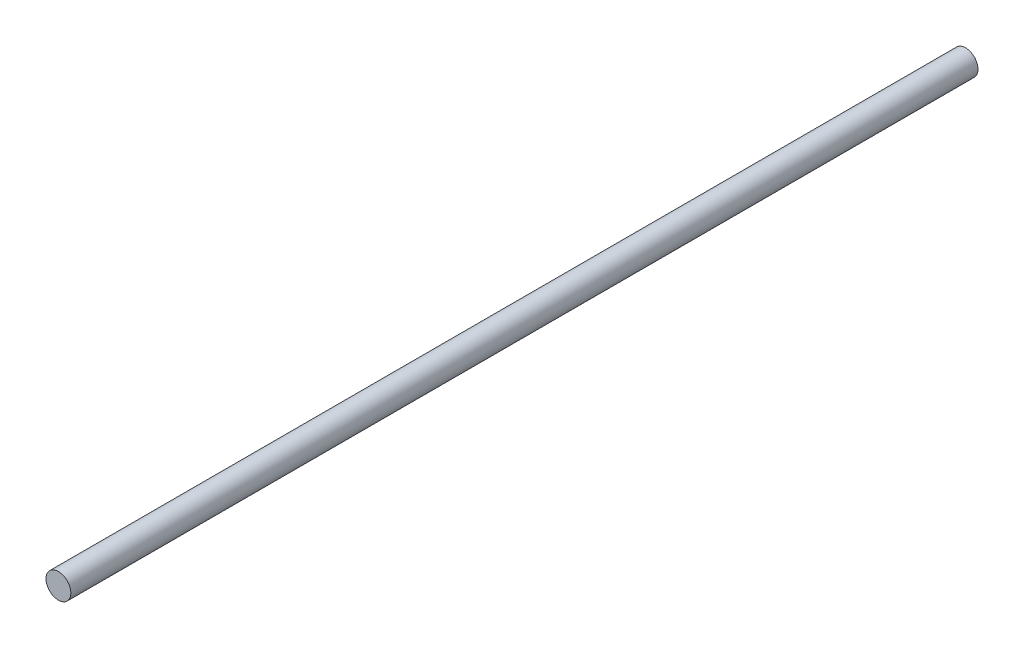
ISO-10303-21;
HEADER;
FILE_DESCRIPTION(('STEP AP214'),'2;1');
FILE_NAME('part.step','',(''),(''),'','','');
FILE_SCHEMA(('AUTOMOTIVE_DESIGN { 1 0 10303 214 1 1 1 1 }'));
ENDSEC;
DATA;
#1=APPLICATION_CONTEXT('core data for automotive mechanical design processes');
#2=APPLICATION_PROTOCOL_DEFINITION('international standard','automotive_design',2000,#1);
#3=PRODUCT_CONTEXT('',#1,'mechanical');
#4=PRODUCT('Part','Part','',(#3));
#5=PRODUCT_RELATED_PRODUCT_CATEGORY('part','',(#4));
#6=PRODUCT_DEFINITION_FORMATION('','',#4);
#7=PRODUCT_DEFINITION_CONTEXT('part definition',#1,'design');
#8=PRODUCT_DEFINITION('design','',#6,#7);
#9=PRODUCT_DEFINITION_SHAPE('','',#8);
#10=(LENGTH_UNIT() NAMED_UNIT(*) SI_UNIT(.MILLI.,.METRE.));
#11=(NAMED_UNIT(*) PLANE_ANGLE_UNIT() SI_UNIT($,.RADIAN.));
#12=(NAMED_UNIT(*) SI_UNIT($,.STERADIAN.) SOLID_ANGLE_UNIT());
#13=UNCERTAINTY_MEASURE_WITH_UNIT(LENGTH_MEASURE(1.E-05),#10,'distance_accuracy_value','');
#14=(GEOMETRIC_REPRESENTATION_CONTEXT(3) GLOBAL_UNCERTAINTY_ASSIGNED_CONTEXT((#13)) GLOBAL_UNIT_ASSIGNED_CONTEXT((#10,
#11,#12)) REPRESENTATION_CONTEXT('',''));
#15=CARTESIAN_POINT('',(0.,0.,0.));
#16=DIRECTION('',(0.,0.,1.));
#17=DIRECTION('',(1.,0.,0.));
#18=AXIS2_PLACEMENT_3D('',#15,#16,#17);
#19=CARTESIAN_POINT('',(0.,0.,182.5));
#20=DIRECTION('',(0.,0.,-1.));
#21=DIRECTION('',(-1.,0.,0.));
#22=AXIS2_PLACEMENT_3D('',#19,#20,#21);
#23=CYLINDRICAL_SURFACE('',#22,5.);
#24=CARTESIAN_POINT('',(0.,0.,182.5));
#25=DIRECTION('',(0.,0.,1.));
#26=DIRECTION('',(1.,0.,0.));
#27=AXIS2_PLACEMENT_3D('',#24,#25,#26);
#28=CIRCLE('',#27,5.);
#29=CARTESIAN_POINT('',(5.,0.,182.5));
#30=VERTEX_POINT('',#29);
#31=EDGE_CURVE('E8',#30,#30,#28,.T.);
#32=ORIENTED_EDGE('',*,*,#31,.F.);
#33=EDGE_LOOP('',(#32));
#34=FACE_BOUND('',#33,.T.);
#35=CARTESIAN_POINT('',(0.,0.,-182.5));
#36=DIRECTION('',(0.,0.,1.));
#37=DIRECTION('',(1.,0.,0.));
#38=AXIS2_PLACEMENT_3D('',#35,#36,#37);
#39=CIRCLE('',#38,5.);
#40=CARTESIAN_POINT('',(5.,0.,-182.5));
#41=VERTEX_POINT('',#40);
#42=EDGE_CURVE('E16',#41,#41,#39,.T.);
#43=ORIENTED_EDGE('',*,*,#42,.T.);
#44=EDGE_LOOP('',(#43));
#45=FACE_BOUND('',#44,.T.);
#46=ADVANCED_FACE('F13',(#34,#45),#23,.T.);
#47=CARTESIAN_POINT('',(0.,0.,182.5));
#48=DIRECTION('',(0.,0.,1.));
#49=DIRECTION('',(1.,0.,0.));
#50=AXIS2_PLACEMENT_3D('',#47,#48,#49);
#51=PLANE('',#50);
#52=ORIENTED_EDGE('',*,*,#31,.T.);
#53=EDGE_LOOP('',(#52));
#54=FACE_BOUND('',#53,.T.);
#55=ADVANCED_FACE('F28',(#54),#51,.T.);
#56=CARTESIAN_POINT('',(0.,0.,-182.5));
#57=DIRECTION('',(0.,0.,1.));
#58=DIRECTION('',(1.,0.,0.));
#59=AXIS2_PLACEMENT_3D('',#56,#57,#58);
#60=PLANE('',#59);
#61=ORIENTED_EDGE('',*,*,#42,.F.);
#62=EDGE_LOOP('',(#61));
#63=FACE_BOUND('',#62,.T.);
#64=ADVANCED_FACE('F26',(#63),#60,.F.);
#65=CLOSED_SHELL('',(#46,#55,#64));
#66=MANIFOLD_SOLID_BREP('B1',#65);
#67=ADVANCED_BREP_SHAPE_REPRESENTATION('',(#18,#66),#14);
#68=SHAPE_DEFINITION_REPRESENTATION(#9,#67);
ENDSEC;
END-ISO-10303-21;
